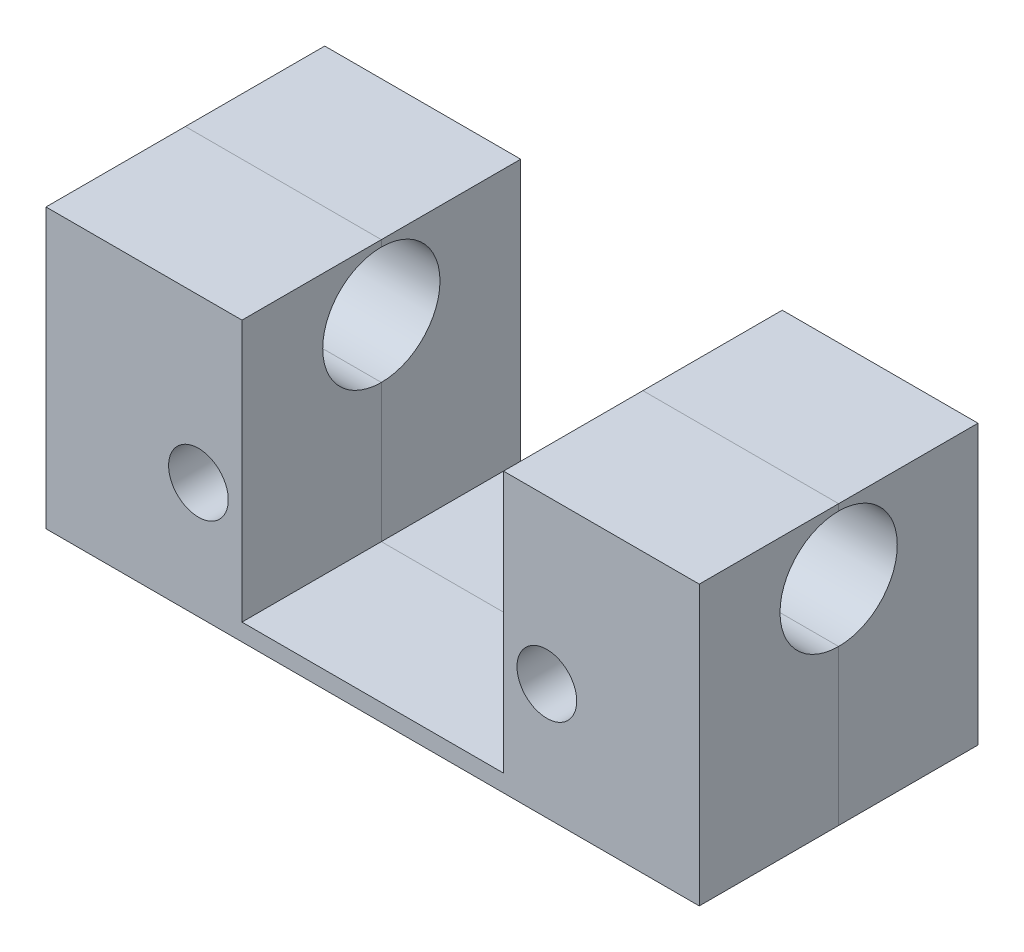
ISO-10303-21;
HEADER;
FILE_DESCRIPTION(('STEP AP214'),'2;1');
FILE_NAME('part.step','',(''),(''),'','','');
FILE_SCHEMA(('AUTOMOTIVE_DESIGN { 1 0 10303 214 1 1 1 1 }'));
ENDSEC;
DATA;
#1=APPLICATION_CONTEXT('core data for automotive mechanical design processes');
#2=APPLICATION_PROTOCOL_DEFINITION('international standard','automotive_design',2000,#1);
#3=PRODUCT_CONTEXT('',#1,'mechanical');
#4=PRODUCT('Part','Part','',(#3));
#5=PRODUCT_RELATED_PRODUCT_CATEGORY('part','',(#4));
#6=PRODUCT_DEFINITION_FORMATION('','',#4);
#7=PRODUCT_DEFINITION_CONTEXT('part definition',#1,'design');
#8=PRODUCT_DEFINITION('design','',#6,#7);
#9=PRODUCT_DEFINITION_SHAPE('','',#8);
#10=(LENGTH_UNIT() NAMED_UNIT(*) SI_UNIT(.MILLI.,.METRE.));
#11=(NAMED_UNIT(*) PLANE_ANGLE_UNIT() SI_UNIT($,.RADIAN.));
#12=(NAMED_UNIT(*) SI_UNIT($,.STERADIAN.) SOLID_ANGLE_UNIT());
#13=UNCERTAINTY_MEASURE_WITH_UNIT(LENGTH_MEASURE(1.E-05),#10,'distance_accuracy_value','');
#14=(GEOMETRIC_REPRESENTATION_CONTEXT(3) GLOBAL_UNCERTAINTY_ASSIGNED_CONTEXT((#13)) GLOBAL_UNIT_ASSIGNED_CONTEXT((#10,
#11,#12)) REPRESENTATION_CONTEXT('',''));
#15=CARTESIAN_POINT('',(0.,0.,0.));
#16=DIRECTION('',(0.,0.,1.));
#17=DIRECTION('',(1.,0.,0.));
#18=AXIS2_PLACEMENT_3D('',#15,#16,#17);
#19=CARTESIAN_POINT('',(0.,0.,0.));
#20=DIRECTION('',(0.,0.,1.));
#21=DIRECTION('',(1.,0.,0.));
#22=AXIS2_PLACEMENT_3D('',#19,#20,#21);
#23=PLANE('',#22);
#24=DIRECTION('',(0.,-1.,0.));
#25=VECTOR('',#24,1.);
#26=CARTESIAN_POINT('',(35.71875,0.,0.));
#27=LINE('',#26,#25);
#28=CARTESIAN_POINT('',(35.71875,30.48,0.));
#29=VERTEX_POINT('',#28);
#30=CARTESIAN_POINT('',(35.71875,29.7794062900681,0.));
#31=VERTEX_POINT('',#30);
#32=EDGE_CURVE('E222',#29,#31,#27,.T.);
#33=ORIENTED_EDGE('',*,*,#32,.F.);
#34=DIRECTION('',(-1.,0.,0.));
#35=VECTOR('',#34,1.);
#36=CARTESIAN_POINT('',(0.,30.48,0.));
#37=LINE('',#36,#35);
#38=CARTESIAN_POINT('',(14.3129,30.48,0.));
#39=VERTEX_POINT('',#38);
#40=EDGE_CURVE('E230',#29,#39,#37,.T.);
#41=ORIENTED_EDGE('',*,*,#40,.T.);
#42=DIRECTION('',(0.,-1.,0.));
#43=VECTOR('',#42,1.);
#44=CARTESIAN_POINT('',(14.3129,30.48,0.));
#45=LINE('',#44,#43);
#46=CARTESIAN_POINT('',(14.3129,29.7794062900681,0.));
#47=VERTEX_POINT('',#46);
#48=EDGE_CURVE('E234',#39,#47,#45,.T.);
#49=ORIENTED_EDGE('',*,*,#48,.T.);
#50=DIRECTION('',(1.,0.,0.));
#51=VECTOR('',#50,1.);
#52=CARTESIAN_POINT('',(-38.4492499999999,29.7794062900681,0.));
#53=LINE('',#52,#51);
#54=EDGE_CURVE('E169',#47,#31,#53,.T.);
#55=ORIENTED_EDGE('',*,*,#54,.T.);
#56=EDGE_LOOP('',(#33,#41,#49,#55));
#57=FACE_BOUND('',#56,.T.);
#58=ADVANCED_FACE('F52',(#57),#23,.T.);
#59=DIRECTION('',(0.,1.,0.));
#60=VECTOR('',#59,1.);
#61=CARTESIAN_POINT('',(-14.2875,30.48,0.));
#62=LINE('',#61,#60);
#63=CARTESIAN_POINT('',(-14.2875,29.7794062900681,0.));
#64=VERTEX_POINT('',#63);
#65=CARTESIAN_POINT('',(-14.2875,30.48,0.));
#66=VERTEX_POINT('',#65);
#67=EDGE_CURVE('E147',#64,#66,#62,.T.);
#68=ORIENTED_EDGE('',*,*,#67,.T.);
#69=DIRECTION('',(-1.,0.,0.));
#70=VECTOR('',#69,1.);
#71=CARTESIAN_POINT('',(0.,30.48,0.));
#72=LINE('',#71,#70);
#73=CARTESIAN_POINT('',(-35.71875,30.48,0.));
#74=VERTEX_POINT('',#73);
#75=EDGE_CURVE('E224',#66,#74,#72,.T.);
#76=ORIENTED_EDGE('',*,*,#75,.T.);
#77=DIRECTION('',(0.,-1.,0.));
#78=VECTOR('',#77,1.);
#79=CARTESIAN_POINT('',(-35.71875,30.48,0.));
#80=LINE('',#79,#78);
#81=CARTESIAN_POINT('',(-35.71875,29.7794062900681,0.));
#82=VERTEX_POINT('',#81);
#83=EDGE_CURVE('E227',#74,#82,#80,.T.);
#84=ORIENTED_EDGE('',*,*,#83,.T.);
#85=DIRECTION('',(1.,0.,0.));
#86=VECTOR('',#85,1.);
#87=CARTESIAN_POINT('',(-38.4492499999999,29.7794062900681,0.));
#88=LINE('',#87,#86);
#89=EDGE_CURVE('E170',#82,#64,#88,.T.);
#90=ORIENTED_EDGE('',*,*,#89,.T.);
#91=EDGE_LOOP('',(#68,#76,#84,#90));
#92=FACE_BOUND('',#91,.T.);
#93=ADVANCED_FACE('F276',(#92),#23,.T.);
#94=CARTESIAN_POINT('',(35.71875,16.9565937099319,0.));
#95=VERTEX_POINT('',#94);
#96=CARTESIAN_POINT('',(35.71875,0.,0.));
#97=VERTEX_POINT('',#96);
#98=EDGE_CURVE('E221',#95,#97,#27,.T.);
#99=ORIENTED_EDGE('',*,*,#98,.F.);
#100=DIRECTION('',(1.,0.,0.));
#101=VECTOR('',#100,1.);
#102=CARTESIAN_POINT('',(-38.4492499999999,16.9565937099319,0.));
#103=LINE('',#102,#101);
#104=CARTESIAN_POINT('',(14.3129,16.9565937099319,0.));
#105=VERTEX_POINT('',#104);
#106=EDGE_CURVE('E173',#95,#105,#103,.F.);
#107=ORIENTED_EDGE('',*,*,#106,.T.);
#108=CARTESIAN_POINT('',(14.3129,1.8796,0.));
#109=VERTEX_POINT('',#108);
#110=EDGE_CURVE('E235',#105,#109,#45,.T.);
#111=ORIENTED_EDGE('',*,*,#110,.T.);
#112=DIRECTION('',(-1.,0.,0.));
#113=VECTOR('',#112,1.);
#114=CARTESIAN_POINT('',(-14.2875,1.8796,0.));
#115=LINE('',#114,#113);
#116=CARTESIAN_POINT('',(-14.2875,1.8796,0.));
#117=VERTEX_POINT('',#116);
#118=EDGE_CURVE('E165',#109,#117,#115,.T.);
#119=ORIENTED_EDGE('',*,*,#118,.T.);
#120=CARTESIAN_POINT('',(-14.2875,16.9565937099319,0.));
#121=VERTEX_POINT('',#120);
#122=EDGE_CURVE('E145',#117,#121,#62,.T.);
#123=ORIENTED_EDGE('',*,*,#122,.T.);
#124=DIRECTION('',(1.,0.,0.));
#125=VECTOR('',#124,1.);
#126=CARTESIAN_POINT('',(-38.4492499999999,16.9565937099319,0.));
#127=LINE('',#126,#125);
#128=CARTESIAN_POINT('',(-35.71875,16.9565937099319,0.));
#129=VERTEX_POINT('',#128);
#130=EDGE_CURVE('E162',#121,#129,#127,.F.);
#131=ORIENTED_EDGE('',*,*,#130,.T.);
#132=CARTESIAN_POINT('',(-35.71875,0.,0.));
#133=VERTEX_POINT('',#132);
#134=EDGE_CURVE('E228',#129,#133,#80,.T.);
#135=ORIENTED_EDGE('',*,*,#134,.T.);
#136=DIRECTION('',(-1.,0.,0.));
#137=VECTOR('',#136,1.);
#138=CARTESIAN_POINT('',(0.,0.,0.));
#139=LINE('',#138,#137);
#140=EDGE_CURVE('E186',#97,#133,#139,.T.);
#141=ORIENTED_EDGE('',*,*,#140,.F.);
#142=EDGE_LOOP('',(#99,#107,#111,#119,#123,#131,#135,#141));
#143=FACE_BOUND('',#142,.T.);
#144=CARTESIAN_POINT('',(19.05,12.7,0.));
#145=DIRECTION('',(0.,0.,1.));
#146=DIRECTION('',(1.,0.,0.));
#147=AXIS2_PLACEMENT_3D('',#144,#145,#146);
#148=CIRCLE('',#147,3.26389999999999);
#149=CARTESIAN_POINT('',(22.3139,12.7,0.));
#150=VERTEX_POINT('',#149);
#151=EDGE_CURVE('E181',#150,#150,#148,.F.);
#152=ORIENTED_EDGE('',*,*,#151,.T.);
#153=EDGE_LOOP('',(#152));
#154=FACE_BOUND('',#153,.T.);
#155=CARTESIAN_POINT('',(-19.05,12.7,0.));
#156=DIRECTION('',(0.,0.,1.));
#157=DIRECTION('',(1.,0.,0.));
#158=AXIS2_PLACEMENT_3D('',#155,#156,#157);
#159=CIRCLE('',#158,3.26389999999999);
#160=CARTESIAN_POINT('',(-15.7861,12.7,0.));
#161=VERTEX_POINT('',#160);
#162=EDGE_CURVE('E175',#161,#161,#159,.F.);
#163=ORIENTED_EDGE('',*,*,#162,.T.);
#164=EDGE_LOOP('',(#163));
#165=FACE_BOUND('',#164,.T.);
#166=ADVANCED_FACE('F159',(#143,#154,#165),#23,.T.);
#167=CARTESIAN_POINT('',(0.,30.48,0.));
#168=DIRECTION('',(0.,-1.,0.));
#169=DIRECTION('',(0.,0.,-1.));
#170=AXIS2_PLACEMENT_3D('',#167,#168,#169);
#171=PLANE('',#170);
#172=ORIENTED_EDGE('',*,*,#75,.F.);
#173=DIRECTION('',(0.,0.,-1.));
#174=VECTOR('',#173,1.);
#175=CARTESIAN_POINT('',(-14.2875,30.48,0.));
#176=LINE('',#175,#174);
#177=CARTESIAN_POINT('',(-14.2875,30.48,-15.24));
#178=VERTEX_POINT('',#177);
#179=EDGE_CURVE('E184',#66,#178,#176,.T.);
#180=ORIENTED_EDGE('',*,*,#179,.T.);
#181=DIRECTION('',(-1.,0.,0.));
#182=VECTOR('',#181,1.);
#183=CARTESIAN_POINT('',(-35.71875,30.48,-15.24));
#184=LINE('',#183,#182);
#185=CARTESIAN_POINT('',(-35.71875,30.48,-15.24));
#186=VERTEX_POINT('',#185);
#187=EDGE_CURVE('E196',#178,#186,#184,.T.);
#188=ORIENTED_EDGE('',*,*,#187,.T.);
#189=DIRECTION('',(0.,0.,1.));
#190=VECTOR('',#189,1.);
#191=CARTESIAN_POINT('',(-35.71875,30.48,15.24));
#192=LINE('',#191,#190);
#193=EDGE_CURVE('E189',#186,#74,#192,.T.);
#194=ORIENTED_EDGE('',*,*,#193,.T.);
#195=EDGE_LOOP('',(#172,#180,#188,#194));
#196=FACE_BOUND('',#195,.T.);
#197=ADVANCED_FACE('F274',(#196),#171,.F.);
#198=CARTESIAN_POINT('',(-14.2875,1.8796,-16.256));
#199=DIRECTION('',(0.,-1.,0.));
#200=DIRECTION('',(0.,0.,-1.));
#201=AXIS2_PLACEMENT_3D('',#198,#199,#200);
#202=PLANE('',#201);
#203=ORIENTED_EDGE('',*,*,#118,.F.);
#204=DIRECTION('',(0.,0.,1.));
#205=VECTOR('',#204,1.);
#206=CARTESIAN_POINT('',(14.3129,1.8796,-16.256));
#207=LINE('',#206,#205);
#208=CARTESIAN_POINT('',(14.3129,1.8796,-15.24));
#209=VERTEX_POINT('',#208);
#210=EDGE_CURVE('E203',#209,#109,#207,.T.);
#211=ORIENTED_EDGE('',*,*,#210,.F.);
#212=DIRECTION('',(1.,0.,0.));
#213=VECTOR('',#212,1.);
#214=CARTESIAN_POINT('',(-35.71875,1.8796,-15.24));
#215=LINE('',#214,#213);
#216=CARTESIAN_POINT('',(-14.2875,1.8796,-15.24));
#217=VERTEX_POINT('',#216);
#218=EDGE_CURVE('E202',#217,#209,#215,.T.);
#219=ORIENTED_EDGE('',*,*,#218,.F.);
#220=DIRECTION('',(0.,0.,1.));
#221=VECTOR('',#220,1.);
#222=CARTESIAN_POINT('',(-14.2875,1.8796,-16.256));
#223=LINE('',#222,#221);
#224=EDGE_CURVE('E205',#217,#117,#223,.T.);
#225=ORIENTED_EDGE('',*,*,#224,.T.);
#226=EDGE_LOOP('',(#203,#211,#219,#225));
#227=FACE_BOUND('',#226,.T.);
#228=ADVANCED_FACE('F242',(#227),#202,.F.);
#229=CARTESIAN_POINT('',(-35.71875,30.48,-15.24));
#230=DIRECTION('',(0.,0.,1.));
#231=DIRECTION('',(1.,0.,0.));
#232=AXIS2_PLACEMENT_3D('',#229,#230,#231);
#233=PLANE('',#232);
#234=CARTESIAN_POINT('',(19.05,12.7,-15.24));
#235=DIRECTION('',(0.,0.,-1.));
#236=DIRECTION('',(-1.,0.,0.));
#237=AXIS2_PLACEMENT_3D('',#234,#235,#236);
#238=CIRCLE('',#237,3.26389999999999);
#239=CARTESIAN_POINT('',(15.7861,12.7,-15.24));
#240=VERTEX_POINT('',#239);
#241=EDGE_CURVE('E12',#240,#240,#238,.T.);
#242=ORIENTED_EDGE('',*,*,#241,.F.);
#243=EDGE_LOOP('',(#242));
#244=FACE_BOUND('',#243,.T.);
#245=CARTESIAN_POINT('',(-19.05,12.7,-15.24));
#246=DIRECTION('',(0.,0.,-1.));
#247=DIRECTION('',(-1.,0.,0.));
#248=AXIS2_PLACEMENT_3D('',#245,#246,#247);
#249=CIRCLE('',#248,3.26389999999999);
#250=CARTESIAN_POINT('',(-22.3139,12.7,-15.24));
#251=VERTEX_POINT('',#250);
#252=EDGE_CURVE('E61',#251,#251,#249,.T.);
#253=ORIENTED_EDGE('',*,*,#252,.F.);
#254=EDGE_LOOP('',(#253));
#255=FACE_BOUND('',#254,.T.);
#256=ORIENTED_EDGE('',*,*,#187,.F.);
#257=DIRECTION('',(0.,-1.,0.));
#258=VECTOR('',#257,1.);
#259=CARTESIAN_POINT('',(-14.2875,30.48,-15.24));
#260=LINE('',#259,#258);
#261=EDGE_CURVE('E245',#178,#217,#260,.T.);
#262=ORIENTED_EDGE('',*,*,#261,.T.);
#263=ORIENTED_EDGE('',*,*,#218,.T.);
#264=DIRECTION('',(0.,1.,0.));
#265=VECTOR('',#264,1.);
#266=CARTESIAN_POINT('',(14.3129,30.48,-15.24));
#267=LINE('',#266,#265);
#268=CARTESIAN_POINT('',(14.3129,30.48,-15.24));
#269=VERTEX_POINT('',#268);
#270=EDGE_CURVE('E69',#209,#269,#267,.T.);
#271=ORIENTED_EDGE('',*,*,#270,.T.);
#272=CARTESIAN_POINT('',(35.71875,30.48,-15.24));
#273=VERTEX_POINT('',#272);
#274=EDGE_CURVE('E191',#273,#269,#184,.T.);
#275=ORIENTED_EDGE('',*,*,#274,.F.);
#276=DIRECTION('',(0.,-1.,0.));
#277=VECTOR('',#276,1.);
#278=CARTESIAN_POINT('',(35.71875,30.48,-15.24));
#279=LINE('',#278,#277);
#280=CARTESIAN_POINT('',(35.71875,0.,-15.24));
#281=VERTEX_POINT('',#280);
#282=EDGE_CURVE('E188',#273,#281,#279,.T.);
#283=ORIENTED_EDGE('',*,*,#282,.T.);
#284=DIRECTION('',(-1.,0.,0.));
#285=VECTOR('',#284,1.);
#286=CARTESIAN_POINT('',(-35.71875,0.,-15.24));
#287=LINE('',#286,#285);
#288=CARTESIAN_POINT('',(-35.71875,0.,-15.24));
#289=VERTEX_POINT('',#288);
#290=EDGE_CURVE('E199',#281,#289,#287,.T.);
#291=ORIENTED_EDGE('',*,*,#290,.T.);
#292=DIRECTION('',(0.,-1.,0.));
#293=VECTOR('',#292,1.);
#294=CARTESIAN_POINT('',(-35.71875,30.48,-15.24));
#295=LINE('',#294,#293);
#296=EDGE_CURVE('E192',#186,#289,#295,.T.);
#297=ORIENTED_EDGE('',*,*,#296,.F.);
#298=EDGE_LOOP('',(#256,#262,#263,#271,#275,#283,#291,#297));
#299=FACE_BOUND('',#298,.T.);
#300=ADVANCED_FACE('F248',(#244,#255,#299),#233,.F.);
#301=CARTESIAN_POINT('',(19.05,12.7,-15.24));
#302=DIRECTION('',(0.,0.,-1.));
#303=DIRECTION('',(-1.,0.,0.));
#304=AXIS2_PLACEMENT_3D('',#301,#302,#303);
#305=CYLINDRICAL_SURFACE('',#304,3.26389999999999);
#306=ORIENTED_EDGE('',*,*,#241,.T.);
#307=EDGE_LOOP('',(#306));
#308=FACE_BOUND('',#307,.T.);
#309=ORIENTED_EDGE('',*,*,#151,.F.);
#310=EDGE_LOOP('',(#309));
#311=FACE_BOUND('',#310,.T.);
#312=ADVANCED_FACE('F302',(#308,#311),#305,.F.);
#313=CARTESIAN_POINT('',(-19.05,12.7,-15.24));
#314=DIRECTION('',(0.,0.,-1.));
#315=DIRECTION('',(-1.,0.,0.));
#316=AXIS2_PLACEMENT_3D('',#313,#314,#315);
#317=CYLINDRICAL_SURFACE('',#316,3.26389999999999);
#318=ORIENTED_EDGE('',*,*,#252,.T.);
#319=EDGE_LOOP('',(#318));
#320=FACE_BOUND('',#319,.T.);
#321=ORIENTED_EDGE('',*,*,#162,.F.);
#322=EDGE_LOOP('',(#321));
#323=FACE_BOUND('',#322,.T.);
#324=ADVANCED_FACE('F295',(#320,#323),#317,.F.);
#325=ORIENTED_EDGE('',*,*,#40,.F.);
#326=DIRECTION('',(0.,0.,-1.));
#327=VECTOR('',#326,1.);
#328=CARTESIAN_POINT('',(35.71875,30.48,15.24));
#329=LINE('',#328,#327);
#330=EDGE_CURVE('E193',#29,#273,#329,.T.);
#331=ORIENTED_EDGE('',*,*,#330,.T.);
#332=ORIENTED_EDGE('',*,*,#274,.T.);
#333=DIRECTION('',(0.,0.,1.));
#334=VECTOR('',#333,1.);
#335=CARTESIAN_POINT('',(14.3129,30.48,0.));
#336=LINE('',#335,#334);
#337=EDGE_CURVE('E74',#269,#39,#336,.T.);
#338=ORIENTED_EDGE('',*,*,#337,.T.);
#339=EDGE_LOOP('',(#325,#331,#332,#338));
#340=FACE_BOUND('',#339,.T.);
#341=ADVANCED_FACE('F288',(#340),#171,.F.);
#342=CARTESIAN_POINT('',(14.3129,30.48,-16.256));
#343=DIRECTION('',(1.,0.,0.));
#344=DIRECTION('',(0.,1.,0.));
#345=AXIS2_PLACEMENT_3D('',#342,#343,#344);
#346=PLANE('',#345);
#347=ORIENTED_EDGE('',*,*,#48,.F.);
#348=ORIENTED_EDGE('',*,*,#337,.F.);
#349=ORIENTED_EDGE('',*,*,#270,.F.);
#350=ORIENTED_EDGE('',*,*,#210,.T.);
#351=ORIENTED_EDGE('',*,*,#110,.F.);
#352=CARTESIAN_POINT('',(14.3129,23.368,0.));
#353=DIRECTION('',(1.,0.,0.));
#354=DIRECTION('',(0.,1.,0.));
#355=AXIS2_PLACEMENT_3D('',#352,#353,#354);
#356=CIRCLE('',#355,6.4114062900681);
#357=EDGE_CURVE('E152',#105,#47,#356,.T.);
#358=ORIENTED_EDGE('',*,*,#357,.T.);
#359=EDGE_LOOP('',(#347,#348,#349,#350,#351,#358));
#360=FACE_BOUND('',#359,.T.);
#361=ADVANCED_FACE('F239',(#360),#346,.F.);
#362=CARTESIAN_POINT('',(-38.4492499999999,23.368,0.));
#363=DIRECTION('',(1.,0.,0.));
#364=DIRECTION('',(0.,0.,-1.));
#365=AXIS2_PLACEMENT_3D('',#362,#363,#364);
#366=CYLINDRICAL_SURFACE('',#365,6.4114062900681);
#367=ORIENTED_EDGE('',*,*,#106,.F.);
#368=CARTESIAN_POINT('',(35.71875,23.368,0.));
#369=DIRECTION('',(1.,0.,0.));
#370=DIRECTION('',(0.,0.,-1.));
#371=AXIS2_PLACEMENT_3D('',#368,#369,#370);
#372=CIRCLE('',#371,6.4114062900681);
#373=EDGE_CURVE('E56',#95,#31,#372,.T.);
#374=ORIENTED_EDGE('',*,*,#373,.T.);
#375=ORIENTED_EDGE('',*,*,#54,.F.);
#376=ORIENTED_EDGE('',*,*,#357,.F.);
#377=EDGE_LOOP('',(#367,#374,#375,#376));
#378=FACE_BOUND('',#377,.T.);
#379=ADVANCED_FACE('F238',(#378),#366,.F.);
#380=CARTESIAN_POINT('',(-35.71875,30.48,15.24));
#381=DIRECTION('',(1.,0.,0.));
#382=DIRECTION('',(0.,0.,-1.));
#383=AXIS2_PLACEMENT_3D('',#380,#381,#382);
#384=PLANE('',#383);
#385=ORIENTED_EDGE('',*,*,#83,.F.);
#386=ORIENTED_EDGE('',*,*,#193,.F.);
#387=ORIENTED_EDGE('',*,*,#296,.T.);
#388=DIRECTION('',(0.,0.,1.));
#389=VECTOR('',#388,1.);
#390=CARTESIAN_POINT('',(-35.71875,0.,15.24));
#391=LINE('',#390,#389);
#392=EDGE_CURVE('E195',#289,#133,#391,.T.);
#393=ORIENTED_EDGE('',*,*,#392,.T.);
#394=ORIENTED_EDGE('',*,*,#134,.F.);
#395=CARTESIAN_POINT('',(-35.71875,23.368,0.));
#396=DIRECTION('',(1.,0.,0.));
#397=DIRECTION('',(0.,0.,-1.));
#398=AXIS2_PLACEMENT_3D('',#395,#396,#397);
#399=CIRCLE('',#398,6.4114062900681);
#400=EDGE_CURVE('E153',#129,#82,#399,.T.);
#401=ORIENTED_EDGE('',*,*,#400,.T.);
#402=EDGE_LOOP('',(#385,#386,#387,#393,#394,#401));
#403=FACE_BOUND('',#402,.T.);
#404=ADVANCED_FACE('F269',(#403),#384,.F.);
#405=CARTESIAN_POINT('',(-14.2875,30.48,-16.256));
#406=DIRECTION('',(-1.,0.,0.));
#407=DIRECTION('',(0.,-1.,0.));
#408=AXIS2_PLACEMENT_3D('',#405,#406,#407);
#409=PLANE('',#408);
#410=ORIENTED_EDGE('',*,*,#122,.F.);
#411=ORIENTED_EDGE('',*,*,#224,.F.);
#412=ORIENTED_EDGE('',*,*,#261,.F.);
#413=ORIENTED_EDGE('',*,*,#179,.F.);
#414=ORIENTED_EDGE('',*,*,#67,.F.);
#415=CARTESIAN_POINT('',(-14.2875,23.368,0.));
#416=DIRECTION('',(-1.,0.,0.));
#417=DIRECTION('',(0.,-1.,0.));
#418=AXIS2_PLACEMENT_3D('',#415,#416,#417);
#419=CIRCLE('',#418,6.4114062900681);
#420=EDGE_CURVE('E141',#64,#121,#419,.T.);
#421=ORIENTED_EDGE('',*,*,#420,.T.);
#422=EDGE_LOOP('',(#410,#411,#412,#413,#414,#421));
#423=FACE_BOUND('',#422,.T.);
#424=ADVANCED_FACE('F143',(#423),#409,.F.);
#425=ORIENTED_EDGE('',*,*,#130,.F.);
#426=ORIENTED_EDGE('',*,*,#420,.F.);
#427=ORIENTED_EDGE('',*,*,#89,.F.);
#428=ORIENTED_EDGE('',*,*,#400,.F.);
#429=EDGE_LOOP('',(#425,#426,#427,#428));
#430=FACE_BOUND('',#429,.T.);
#431=ADVANCED_FACE('F167',(#430),#366,.F.);
#432=CARTESIAN_POINT('',(0.,0.,0.));
#433=DIRECTION('',(0.,-1.,0.));
#434=DIRECTION('',(0.,0.,-1.));
#435=AXIS2_PLACEMENT_3D('',#432,#433,#434);
#436=PLANE('',#435);
#437=DIRECTION('',(0.,0.,-1.));
#438=VECTOR('',#437,1.);
#439=CARTESIAN_POINT('',(35.71875,0.,15.24));
#440=LINE('',#439,#438);
#441=EDGE_CURVE('E200',#97,#281,#440,.T.);
#442=ORIENTED_EDGE('',*,*,#441,.F.);
#443=ORIENTED_EDGE('',*,*,#140,.T.);
#444=ORIENTED_EDGE('',*,*,#392,.F.);
#445=ORIENTED_EDGE('',*,*,#290,.F.);
#446=EDGE_LOOP('',(#442,#443,#444,#445));
#447=FACE_BOUND('',#446,.T.);
#448=ADVANCED_FACE('F266',(#447),#436,.T.);
#449=CARTESIAN_POINT('',(35.71875,30.48,15.24));
#450=DIRECTION('',(-1.,0.,0.));
#451=DIRECTION('',(0.,0.,1.));
#452=AXIS2_PLACEMENT_3D('',#449,#450,#451);
#453=PLANE('',#452);
#454=ORIENTED_EDGE('',*,*,#330,.F.);
#455=ORIENTED_EDGE('',*,*,#32,.T.);
#456=ORIENTED_EDGE('',*,*,#373,.F.);
#457=ORIENTED_EDGE('',*,*,#98,.T.);
#458=ORIENTED_EDGE('',*,*,#441,.T.);
#459=ORIENTED_EDGE('',*,*,#282,.F.);
#460=EDGE_LOOP('',(#454,#455,#456,#457,#458,#459));
#461=FACE_BOUND('',#460,.T.);
#462=ADVANCED_FACE('F54',(#461),#453,.F.);
#463=CLOSED_SHELL('',(#58,#93,#166,#197,#228,#300,#312,#324,#341,#361,#379,#404,#424,#431,#448,#462));
#464=MANIFOLD_SOLID_BREP('B2',#463);
#465=CARTESIAN_POINT('',(0.,0.,0.));
#466=DIRECTION('',(0.,0.,1.));
#467=DIRECTION('',(1.,0.,0.));
#468=AXIS2_PLACEMENT_3D('',#465,#466,#467);
#469=PLANE('',#468);
#470=DIRECTION('',(0.,-1.,0.));
#471=VECTOR('',#470,1.);
#472=CARTESIAN_POINT('',(35.71875,0.,0.));
#473=LINE('',#472,#471);
#474=CARTESIAN_POINT('',(35.71875,30.48,0.));
#475=VERTEX_POINT('',#474);
#476=CARTESIAN_POINT('',(35.71875,29.7794062900681,0.));
#477=VERTEX_POINT('',#476);
#478=EDGE_CURVE('E604',#475,#477,#473,.T.);
#479=ORIENTED_EDGE('',*,*,#478,.T.);
#480=DIRECTION('',(1.,0.,0.));
#481=VECTOR('',#480,1.);
#482=CARTESIAN_POINT('',(-38.4492499999999,29.7794062900681,0.));
#483=LINE('',#482,#481);
#484=CARTESIAN_POINT('',(14.3129,29.7794062900681,0.));
#485=VERTEX_POINT('',#484);
#486=EDGE_CURVE('E624',#485,#477,#483,.T.);
#487=ORIENTED_EDGE('',*,*,#486,.F.);
#488=DIRECTION('',(0.,-1.,0.));
#489=VECTOR('',#488,1.);
#490=CARTESIAN_POINT('',(14.3129,30.48,0.));
#491=LINE('',#490,#489);
#492=CARTESIAN_POINT('',(14.3129,30.48,0.));
#493=VERTEX_POINT('',#492);
#494=EDGE_CURVE('E627',#493,#485,#491,.T.);
#495=ORIENTED_EDGE('',*,*,#494,.F.);
#496=DIRECTION('',(-1.,0.,0.));
#497=VECTOR('',#496,1.);
#498=CARTESIAN_POINT('',(0.,30.48,0.));
#499=LINE('',#498,#497);
#500=EDGE_CURVE('E431',#475,#493,#499,.T.);
#501=ORIENTED_EDGE('',*,*,#500,.F.);
#502=EDGE_LOOP('',(#479,#487,#495,#501));
#503=FACE_BOUND('',#502,.T.);
#504=ADVANCED_FACE('F428',(#503),#469,.F.);
#505=DIRECTION('',(0.,1.,0.));
#506=VECTOR('',#505,1.);
#507=CARTESIAN_POINT('',(-14.2875,30.48,0.));
#508=LINE('',#507,#506);
#509=CARTESIAN_POINT('',(-14.2875,29.7794062900681,0.));
#510=VERTEX_POINT('',#509);
#511=CARTESIAN_POINT('',(-14.2875,30.48,0.));
#512=VERTEX_POINT('',#511);
#513=EDGE_CURVE('E615',#510,#512,#508,.T.);
#514=ORIENTED_EDGE('',*,*,#513,.F.);
#515=DIRECTION('',(1.,0.,0.));
#516=VECTOR('',#515,1.);
#517=CARTESIAN_POINT('',(-38.4492499999999,29.7794062900681,0.));
#518=LINE('',#517,#516);
#519=CARTESIAN_POINT('',(-35.71875,29.7794062900681,0.));
#520=VERTEX_POINT('',#519);
#521=EDGE_CURVE('E608',#520,#510,#518,.T.);
#522=ORIENTED_EDGE('',*,*,#521,.F.);
#523=DIRECTION('',(0.,-1.,0.));
#524=VECTOR('',#523,1.);
#525=CARTESIAN_POINT('',(-35.71875,30.48,0.));
#526=LINE('',#525,#524);
#527=CARTESIAN_POINT('',(-35.71875,30.48,0.));
#528=VERTEX_POINT('',#527);
#529=EDGE_CURVE('E616',#528,#520,#526,.T.);
#530=ORIENTED_EDGE('',*,*,#529,.F.);
#531=DIRECTION('',(-1.,0.,0.));
#532=VECTOR('',#531,1.);
#533=CARTESIAN_POINT('',(0.,30.48,0.));
#534=LINE('',#533,#532);
#535=EDGE_CURVE('E619',#512,#528,#534,.T.);
#536=ORIENTED_EDGE('',*,*,#535,.F.);
#537=EDGE_LOOP('',(#514,#522,#530,#536));
#538=FACE_BOUND('',#537,.T.);
#539=ADVANCED_FACE('F688',(#538),#469,.F.);
#540=CARTESIAN_POINT('',(-19.05,12.7,0.));
#541=DIRECTION('',(0.,0.,1.));
#542=DIRECTION('',(1.,0.,0.));
#543=AXIS2_PLACEMENT_3D('',#540,#541,#542);
#544=CIRCLE('',#543,3.26389999999999);
#545=CARTESIAN_POINT('',(-15.7861,12.7,0.));
#546=VERTEX_POINT('',#545);
#547=EDGE_CURVE('E601',#546,#546,#544,.F.);
#548=ORIENTED_EDGE('',*,*,#547,.F.);
#549=EDGE_LOOP('',(#548));
#550=FACE_BOUND('',#549,.T.);
#551=CARTESIAN_POINT('',(19.05,12.7,0.));
#552=DIRECTION('',(0.,0.,1.));
#553=DIRECTION('',(1.,0.,0.));
#554=AXIS2_PLACEMENT_3D('',#551,#552,#553);
#555=CIRCLE('',#554,3.26389999999999);
#556=CARTESIAN_POINT('',(22.3139,12.7,0.));
#557=VERTEX_POINT('',#556);
#558=EDGE_CURVE('E591',#557,#557,#555,.F.);
#559=ORIENTED_EDGE('',*,*,#558,.F.);
#560=EDGE_LOOP('',(#559));
#561=FACE_BOUND('',#560,.T.);
#562=CARTESIAN_POINT('',(35.71875,16.9565937099319,0.));
#563=VERTEX_POINT('',#562);
#564=CARTESIAN_POINT('',(35.71875,0.,0.));
#565=VERTEX_POINT('',#564);
#566=EDGE_CURVE('E437',#563,#565,#473,.T.);
#567=ORIENTED_EDGE('',*,*,#566,.T.);
#568=DIRECTION('',(-1.,0.,0.));
#569=VECTOR('',#568,1.);
#570=CARTESIAN_POINT('',(0.,0.,0.));
#571=LINE('',#570,#569);
#572=CARTESIAN_POINT('',(-35.71875,0.,0.));
#573=VERTEX_POINT('',#572);
#574=EDGE_CURVE('E50',#565,#573,#571,.T.);
#575=ORIENTED_EDGE('',*,*,#574,.T.);
#576=CARTESIAN_POINT('',(-35.71875,16.9565937099319,0.));
#577=VERTEX_POINT('',#576);
#578=EDGE_CURVE('E451',#577,#573,#526,.T.);
#579=ORIENTED_EDGE('',*,*,#578,.F.);
#580=DIRECTION('',(1.,0.,0.));
#581=VECTOR('',#580,1.);
#582=CARTESIAN_POINT('',(-38.4492499999999,16.9565937099319,0.));
#583=LINE('',#582,#581);
#584=CARTESIAN_POINT('',(-14.2875,16.9565937099319,0.));
#585=VERTEX_POINT('',#584);
#586=EDGE_CURVE('E611',#585,#577,#583,.F.);
#587=ORIENTED_EDGE('',*,*,#586,.F.);
#588=CARTESIAN_POINT('',(-14.2875,1.8796,0.));
#589=VERTEX_POINT('',#588);
#590=EDGE_CURVE('E612',#589,#585,#508,.T.);
#591=ORIENTED_EDGE('',*,*,#590,.F.);
#592=DIRECTION('',(-1.,0.,0.));
#593=VECTOR('',#592,1.);
#594=CARTESIAN_POINT('',(-14.2875,1.8796,0.));
#595=LINE('',#594,#593);
#596=CARTESIAN_POINT('',(14.3129,1.8796,0.));
#597=VERTEX_POINT('',#596);
#598=EDGE_CURVE('E527',#597,#589,#595,.T.);
#599=ORIENTED_EDGE('',*,*,#598,.F.);
#600=CARTESIAN_POINT('',(14.3129,16.9565937099319,0.));
#601=VERTEX_POINT('',#600);
#602=EDGE_CURVE('E629',#601,#597,#491,.T.);
#603=ORIENTED_EDGE('',*,*,#602,.F.);
#604=DIRECTION('',(1.,0.,0.));
#605=VECTOR('',#604,1.);
#606=CARTESIAN_POINT('',(-38.4492499999999,16.9565937099319,0.));
#607=LINE('',#606,#605);
#608=EDGE_CURVE('E631',#563,#601,#607,.F.);
#609=ORIENTED_EDGE('',*,*,#608,.F.);
#610=EDGE_LOOP('',(#567,#575,#579,#587,#591,#599,#603,#609));
#611=FACE_BOUND('',#610,.T.);
#612=ADVANCED_FACE('F672',(#550,#561,#611),#469,.F.);
#613=CARTESIAN_POINT('',(0.,30.48,0.));
#614=DIRECTION('',(0.,-1.,0.));
#615=DIRECTION('',(0.,0.,-1.));
#616=AXIS2_PLACEMENT_3D('',#613,#614,#615);
#617=PLANE('',#616);
#618=DIRECTION('',(0.,0.,-1.));
#619=VECTOR('',#618,1.);
#620=CARTESIAN_POINT('',(-14.2875,30.48,0.));
#621=LINE('',#620,#619);
#622=CARTESIAN_POINT('',(-14.2875,30.48,15.24));
#623=VERTEX_POINT('',#622);
#624=EDGE_CURVE('E539',#623,#512,#621,.T.);
#625=ORIENTED_EDGE('',*,*,#624,.T.);
#626=ORIENTED_EDGE('',*,*,#535,.T.);
#627=DIRECTION('',(0.,0.,1.));
#628=VECTOR('',#627,1.);
#629=CARTESIAN_POINT('',(-35.71875,30.48,15.24));
#630=LINE('',#629,#628);
#631=CARTESIAN_POINT('',(-35.71875,30.48,15.24));
#632=VERTEX_POINT('',#631);
#633=EDGE_CURVE('E562',#528,#632,#630,.T.);
#634=ORIENTED_EDGE('',*,*,#633,.T.);
#635=DIRECTION('',(1.,0.,0.));
#636=VECTOR('',#635,1.);
#637=CARTESIAN_POINT('',(-35.71875,30.48,15.24));
#638=LINE('',#637,#636);
#639=EDGE_CURVE('E567',#632,#623,#638,.T.);
#640=ORIENTED_EDGE('',*,*,#639,.T.);
#641=EDGE_LOOP('',(#625,#626,#634,#640));
#642=FACE_BOUND('',#641,.T.);
#643=ADVANCED_FACE('F686',(#642),#617,.F.);
#644=CARTESIAN_POINT('',(-35.71875,30.48,15.24));
#645=DIRECTION('',(0.,0.,-1.));
#646=DIRECTION('',(-1.,0.,0.));
#647=AXIS2_PLACEMENT_3D('',#644,#645,#646);
#648=PLANE('',#647);
#649=CARTESIAN_POINT('',(19.05,12.7,15.24));
#650=DIRECTION('',(0.,0.,-1.));
#651=DIRECTION('',(-1.,0.,0.));
#652=AXIS2_PLACEMENT_3D('',#649,#650,#651);
#653=CIRCLE('',#652,3.26389999999999);
#654=CARTESIAN_POINT('',(15.7861,12.7,15.24));
#655=VERTEX_POINT('',#654);
#656=EDGE_CURVE('E654',#655,#655,#653,.T.);
#657=ORIENTED_EDGE('',*,*,#656,.T.);
#658=EDGE_LOOP('',(#657));
#659=FACE_BOUND('',#658,.T.);
#660=CARTESIAN_POINT('',(-19.05,12.7,15.24));
#661=DIRECTION('',(0.,0.,-1.));
#662=DIRECTION('',(-1.,0.,0.));
#663=AXIS2_PLACEMENT_3D('',#660,#661,#662);
#664=CIRCLE('',#663,3.26389999999999);
#665=CARTESIAN_POINT('',(-22.3139,12.7,15.24));
#666=VERTEX_POINT('',#665);
#667=EDGE_CURVE('E650',#666,#666,#664,.T.);
#668=ORIENTED_EDGE('',*,*,#667,.T.);
#669=EDGE_LOOP('',(#668));
#670=FACE_BOUND('',#669,.T.);
#671=DIRECTION('',(1.,0.,0.));
#672=VECTOR('',#671,1.);
#673=CARTESIAN_POINT('',(-14.2875,1.8796,15.24));
#674=LINE('',#673,#672);
#675=CARTESIAN_POINT('',(-14.2875,1.8796,15.24));
#676=VERTEX_POINT('',#675);
#677=CARTESIAN_POINT('',(14.3129,1.8796,15.24));
#678=VERTEX_POINT('',#677);
#679=EDGE_CURVE('E524',#676,#678,#674,.T.);
#680=ORIENTED_EDGE('',*,*,#679,.F.);
#681=DIRECTION('',(0.,-1.,0.));
#682=VECTOR('',#681,1.);
#683=CARTESIAN_POINT('',(-14.2875,30.48,15.24));
#684=LINE('',#683,#682);
#685=EDGE_CURVE('E535',#623,#676,#684,.T.);
#686=ORIENTED_EDGE('',*,*,#685,.F.);
#687=ORIENTED_EDGE('',*,*,#639,.F.);
#688=DIRECTION('',(0.,-1.,0.));
#689=VECTOR('',#688,1.);
#690=CARTESIAN_POINT('',(-35.71875,30.48,15.24));
#691=LINE('',#690,#689);
#692=CARTESIAN_POINT('',(-35.71875,0.,15.24));
#693=VERTEX_POINT('',#692);
#694=EDGE_CURVE('E582',#632,#693,#691,.T.);
#695=ORIENTED_EDGE('',*,*,#694,.T.);
#696=DIRECTION('',(1.,0.,0.));
#697=VECTOR('',#696,1.);
#698=CARTESIAN_POINT('',(-35.71875,0.,15.24));
#699=LINE('',#698,#697);
#700=CARTESIAN_POINT('',(35.71875,0.,15.24));
#701=VERTEX_POINT('',#700);
#702=EDGE_CURVE('E563',#693,#701,#699,.T.);
#703=ORIENTED_EDGE('',*,*,#702,.T.);
#704=DIRECTION('',(0.,-1.,0.));
#705=VECTOR('',#704,1.);
#706=CARTESIAN_POINT('',(35.71875,30.48,15.24));
#707=LINE('',#706,#705);
#708=CARTESIAN_POINT('',(35.71875,30.48,15.24));
#709=VERTEX_POINT('',#708);
#710=EDGE_CURVE('E570',#709,#701,#707,.T.);
#711=ORIENTED_EDGE('',*,*,#710,.F.);
#712=CARTESIAN_POINT('',(14.3129,30.48,15.24));
#713=VERTEX_POINT('',#712);
#714=EDGE_CURVE('E566',#713,#709,#638,.T.);
#715=ORIENTED_EDGE('',*,*,#714,.F.);
#716=DIRECTION('',(0.,1.,0.));
#717=VECTOR('',#716,1.);
#718=CARTESIAN_POINT('',(14.3129,30.48,15.24));
#719=LINE('',#718,#717);
#720=EDGE_CURVE('E532',#678,#713,#719,.T.);
#721=ORIENTED_EDGE('',*,*,#720,.F.);
#722=EDGE_LOOP('',(#680,#686,#687,#695,#703,#711,#715,#721));
#723=FACE_BOUND('',#722,.T.);
#724=ADVANCED_FACE('F546',(#659,#670,#723),#648,.F.);
#725=CARTESIAN_POINT('',(19.05,12.7,-15.24));
#726=DIRECTION('',(0.,0.,-1.));
#727=DIRECTION('',(-1.,0.,0.));
#728=AXIS2_PLACEMENT_3D('',#725,#726,#727);
#729=CYLINDRICAL_SURFACE('',#728,3.26389999999999);
#730=ORIENTED_EDGE('',*,*,#558,.T.);
#731=EDGE_LOOP('',(#730));
#732=FACE_BOUND('',#731,.T.);
#733=ORIENTED_EDGE('',*,*,#656,.F.);
#734=EDGE_LOOP('',(#733));
#735=FACE_BOUND('',#734,.T.);
#736=ADVANCED_FACE('F729',(#732,#735),#729,.F.);
#737=CARTESIAN_POINT('',(-19.05,12.7,-15.24));
#738=DIRECTION('',(0.,0.,-1.));
#739=DIRECTION('',(-1.,0.,0.));
#740=AXIS2_PLACEMENT_3D('',#737,#738,#739);
#741=CYLINDRICAL_SURFACE('',#740,3.26389999999999);
#742=ORIENTED_EDGE('',*,*,#547,.T.);
#743=EDGE_LOOP('',(#742));
#744=FACE_BOUND('',#743,.T.);
#745=ORIENTED_EDGE('',*,*,#667,.F.);
#746=EDGE_LOOP('',(#745));
#747=FACE_BOUND('',#746,.T.);
#748=ADVANCED_FACE('F741',(#744,#747),#741,.F.);
#749=CARTESIAN_POINT('',(-14.2875,1.8796,-16.256));
#750=DIRECTION('',(0.,-1.,0.));
#751=DIRECTION('',(0.,0.,-1.));
#752=AXIS2_PLACEMENT_3D('',#749,#750,#751);
#753=PLANE('',#752);
#754=DIRECTION('',(0.,0.,1.));
#755=VECTOR('',#754,1.);
#756=CARTESIAN_POINT('',(14.3129,1.8796,-16.256));
#757=LINE('',#756,#755);
#758=EDGE_CURVE('E531',#597,#678,#757,.T.);
#759=ORIENTED_EDGE('',*,*,#758,.F.);
#760=ORIENTED_EDGE('',*,*,#598,.T.);
#761=DIRECTION('',(0.,0.,1.));
#762=VECTOR('',#761,1.);
#763=CARTESIAN_POINT('',(-14.2875,1.8796,-16.256));
#764=LINE('',#763,#762);
#765=EDGE_CURVE('E519',#589,#676,#764,.T.);
#766=ORIENTED_EDGE('',*,*,#765,.T.);
#767=ORIENTED_EDGE('',*,*,#679,.T.);
#768=EDGE_LOOP('',(#759,#760,#766,#767));
#769=FACE_BOUND('',#768,.T.);
#770=ADVANCED_FACE('F522',(#769),#753,.F.);
#771=DIRECTION('',(0.,0.,-1.));
#772=VECTOR('',#771,1.);
#773=CARTESIAN_POINT('',(35.71875,30.48,15.24));
#774=LINE('',#773,#772);
#775=EDGE_CURVE('E558',#709,#475,#774,.T.);
#776=ORIENTED_EDGE('',*,*,#775,.T.);
#777=ORIENTED_EDGE('',*,*,#500,.T.);
#778=DIRECTION('',(0.,0.,1.));
#779=VECTOR('',#778,1.);
#780=CARTESIAN_POINT('',(14.3129,30.48,0.));
#781=LINE('',#780,#779);
#782=EDGE_CURVE('E586',#493,#713,#781,.T.);
#783=ORIENTED_EDGE('',*,*,#782,.T.);
#784=ORIENTED_EDGE('',*,*,#714,.T.);
#785=EDGE_LOOP('',(#776,#777,#783,#784));
#786=FACE_BOUND('',#785,.T.);
#787=ADVANCED_FACE('F676',(#786),#617,.F.);
#788=CARTESIAN_POINT('',(14.3129,30.48,-16.256));
#789=DIRECTION('',(1.,0.,0.));
#790=DIRECTION('',(0.,1.,0.));
#791=AXIS2_PLACEMENT_3D('',#788,#789,#790);
#792=PLANE('',#791);
#793=ORIENTED_EDGE('',*,*,#782,.F.);
#794=ORIENTED_EDGE('',*,*,#494,.T.);
#795=CARTESIAN_POINT('',(14.3129,23.368,0.));
#796=DIRECTION('',(1.,0.,0.));
#797=DIRECTION('',(0.,1.,0.));
#798=AXIS2_PLACEMENT_3D('',#795,#796,#797);
#799=CIRCLE('',#798,6.4114062900681);
#800=EDGE_CURVE('E592',#485,#601,#799,.T.);
#801=ORIENTED_EDGE('',*,*,#800,.T.);
#802=ORIENTED_EDGE('',*,*,#602,.T.);
#803=ORIENTED_EDGE('',*,*,#758,.T.);
#804=ORIENTED_EDGE('',*,*,#720,.T.);
#805=EDGE_LOOP('',(#793,#794,#801,#802,#803,#804));
#806=FACE_BOUND('',#805,.T.);
#807=ADVANCED_FACE('F679',(#806),#792,.F.);
#808=CARTESIAN_POINT('',(-38.4492499999999,23.368,0.));
#809=DIRECTION('',(1.,0.,0.));
#810=DIRECTION('',(0.,0.,-1.));
#811=AXIS2_PLACEMENT_3D('',#808,#809,#810);
#812=CYLINDRICAL_SURFACE('',#811,6.4114062900681);
#813=CARTESIAN_POINT('',(35.71875,23.368,0.));
#814=DIRECTION('',(1.,0.,0.));
#815=DIRECTION('',(0.,0.,-1.));
#816=AXIS2_PLACEMENT_3D('',#813,#814,#815);
#817=CIRCLE('',#816,6.4114062900681);
#818=EDGE_CURVE('E597',#477,#563,#817,.T.);
#819=ORIENTED_EDGE('',*,*,#818,.T.);
#820=ORIENTED_EDGE('',*,*,#608,.T.);
#821=ORIENTED_EDGE('',*,*,#800,.F.);
#822=ORIENTED_EDGE('',*,*,#486,.T.);
#823=EDGE_LOOP('',(#819,#820,#821,#822));
#824=FACE_BOUND('',#823,.T.);
#825=ADVANCED_FACE('F639',(#824),#812,.F.);
#826=CARTESIAN_POINT('',(-35.71875,30.48,15.24));
#827=DIRECTION('',(1.,0.,0.));
#828=DIRECTION('',(0.,0.,-1.));
#829=AXIS2_PLACEMENT_3D('',#826,#827,#828);
#830=PLANE('',#829);
#831=ORIENTED_EDGE('',*,*,#633,.F.);
#832=ORIENTED_EDGE('',*,*,#529,.T.);
#833=CARTESIAN_POINT('',(-35.71875,23.368,0.));
#834=DIRECTION('',(1.,0.,0.));
#835=DIRECTION('',(0.,0.,-1.));
#836=AXIS2_PLACEMENT_3D('',#833,#834,#835);
#837=CIRCLE('',#836,6.4114062900681);
#838=EDGE_CURVE('E544',#520,#577,#837,.T.);
#839=ORIENTED_EDGE('',*,*,#838,.T.);
#840=ORIENTED_EDGE('',*,*,#578,.T.);
#841=DIRECTION('',(0.,0.,1.));
#842=VECTOR('',#841,1.);
#843=CARTESIAN_POINT('',(-35.71875,0.,15.24));
#844=LINE('',#843,#842);
#845=EDGE_CURVE('E574',#573,#693,#844,.T.);
#846=ORIENTED_EDGE('',*,*,#845,.T.);
#847=ORIENTED_EDGE('',*,*,#694,.F.);
#848=EDGE_LOOP('',(#831,#832,#839,#840,#846,#847));
#849=FACE_BOUND('',#848,.T.);
#850=ADVANCED_FACE('F663',(#849),#830,.F.);
#851=CARTESIAN_POINT('',(-14.2875,30.48,-16.256));
#852=DIRECTION('',(-1.,0.,0.));
#853=DIRECTION('',(0.,-1.,0.));
#854=AXIS2_PLACEMENT_3D('',#851,#852,#853);
#855=PLANE('',#854);
#856=ORIENTED_EDGE('',*,*,#765,.F.);
#857=ORIENTED_EDGE('',*,*,#590,.T.);
#858=CARTESIAN_POINT('',(-14.2875,23.368,0.));
#859=DIRECTION('',(-1.,0.,0.));
#860=DIRECTION('',(0.,-1.,0.));
#861=AXIS2_PLACEMENT_3D('',#858,#859,#860);
#862=CIRCLE('',#861,6.4114062900681);
#863=EDGE_CURVE('E596',#585,#510,#862,.T.);
#864=ORIENTED_EDGE('',*,*,#863,.T.);
#865=ORIENTED_EDGE('',*,*,#513,.T.);
#866=ORIENTED_EDGE('',*,*,#624,.F.);
#867=ORIENTED_EDGE('',*,*,#685,.T.);
#868=EDGE_LOOP('',(#856,#857,#864,#865,#866,#867));
#869=FACE_BOUND('',#868,.T.);
#870=ADVANCED_FACE('F536',(#869),#855,.F.);
#871=ORIENTED_EDGE('',*,*,#863,.F.);
#872=ORIENTED_EDGE('',*,*,#586,.T.);
#873=ORIENTED_EDGE('',*,*,#838,.F.);
#874=ORIENTED_EDGE('',*,*,#521,.T.);
#875=EDGE_LOOP('',(#871,#872,#873,#874));
#876=FACE_BOUND('',#875,.T.);
#877=ADVANCED_FACE('F668',(#876),#812,.F.);
#878=CARTESIAN_POINT('',(0.,0.,0.));
#879=DIRECTION('',(0.,-1.,0.));
#880=DIRECTION('',(0.,0.,-1.));
#881=AXIS2_PLACEMENT_3D('',#878,#879,#880);
#882=PLANE('',#881);
#883=ORIENTED_EDGE('',*,*,#574,.F.);
#884=DIRECTION('',(0.,0.,-1.));
#885=VECTOR('',#884,1.);
#886=CARTESIAN_POINT('',(35.71875,0.,15.24));
#887=LINE('',#886,#885);
#888=EDGE_CURVE('E556',#701,#565,#887,.T.);
#889=ORIENTED_EDGE('',*,*,#888,.F.);
#890=ORIENTED_EDGE('',*,*,#702,.F.);
#891=ORIENTED_EDGE('',*,*,#845,.F.);
#892=EDGE_LOOP('',(#883,#889,#890,#891));
#893=FACE_BOUND('',#892,.T.);
#894=ADVANCED_FACE('F683',(#893),#882,.T.);
#895=CARTESIAN_POINT('',(35.71875,30.48,15.24));
#896=DIRECTION('',(-1.,0.,0.));
#897=DIRECTION('',(0.,0.,1.));
#898=AXIS2_PLACEMENT_3D('',#895,#896,#897);
#899=PLANE('',#898);
#900=ORIENTED_EDGE('',*,*,#478,.F.);
#901=ORIENTED_EDGE('',*,*,#775,.F.);
#902=ORIENTED_EDGE('',*,*,#710,.T.);
#903=ORIENTED_EDGE('',*,*,#888,.T.);
#904=ORIENTED_EDGE('',*,*,#566,.F.);
#905=ORIENTED_EDGE('',*,*,#818,.F.);
#906=EDGE_LOOP('',(#900,#901,#902,#903,#904,#905));
#907=FACE_BOUND('',#906,.T.);
#908=ADVANCED_FACE('F648',(#907),#899,.F.);
#909=CLOSED_SHELL('',(#504,#539,#612,#643,#724,#736,#748,#770,#787,#807,#825,#850,#870,#877,
#894,#908));
#910=MANIFOLD_SOLID_BREP('B6',#909);
#911=ADVANCED_BREP_SHAPE_REPRESENTATION('',(#18,#464,#910),#14);
#912=SHAPE_DEFINITION_REPRESENTATION(#9,#911);
ENDSEC;
END-ISO-10303-21;
